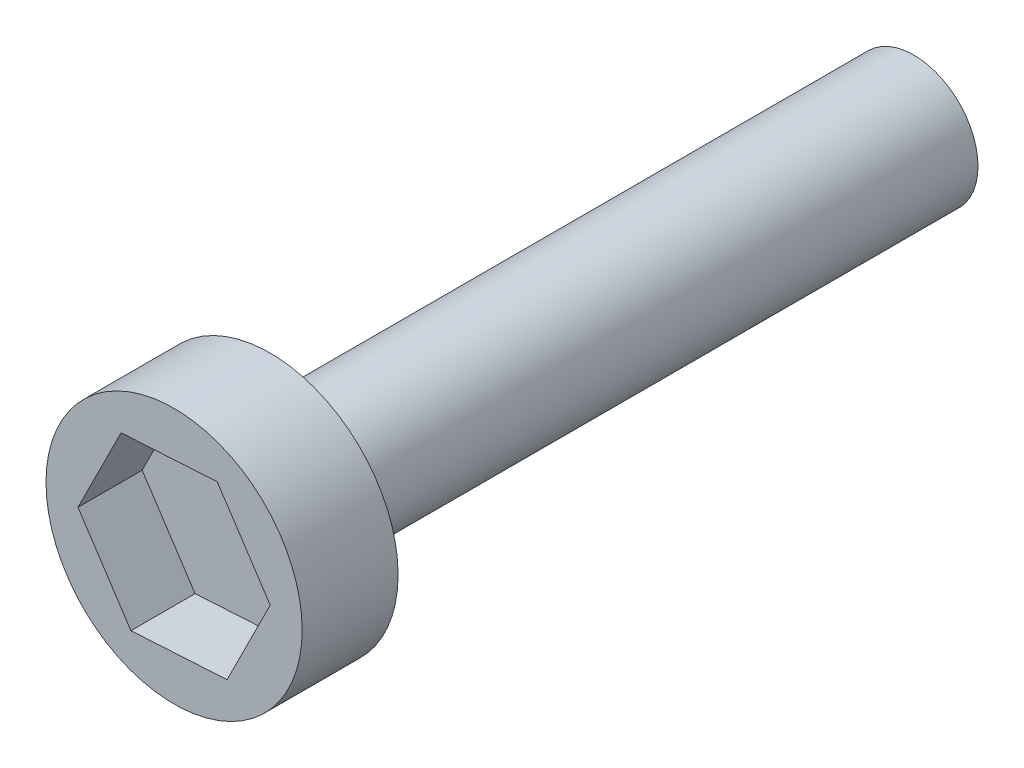
ISO-10303-21;
HEADER;
FILE_DESCRIPTION(('STEP AP214'),'2;1');
FILE_NAME('part.step','',(''),(''),'','','');
FILE_SCHEMA(('AUTOMOTIVE_DESIGN { 1 0 10303 214 1 1 1 1 }'));
ENDSEC;
DATA;
#1=APPLICATION_CONTEXT('core data for automotive mechanical design processes');
#2=APPLICATION_PROTOCOL_DEFINITION('international standard','automotive_design',2000,#1);
#3=PRODUCT_CONTEXT('',#1,'mechanical');
#4=PRODUCT('Part','Part','',(#3));
#5=PRODUCT_RELATED_PRODUCT_CATEGORY('part','',(#4));
#6=PRODUCT_DEFINITION_FORMATION('','',#4);
#7=PRODUCT_DEFINITION_CONTEXT('part definition',#1,'design');
#8=PRODUCT_DEFINITION('design','',#6,#7);
#9=PRODUCT_DEFINITION_SHAPE('','',#8);
#10=(LENGTH_UNIT() NAMED_UNIT(*) SI_UNIT(.MILLI.,.METRE.));
#11=(NAMED_UNIT(*) PLANE_ANGLE_UNIT() SI_UNIT($,.RADIAN.));
#12=(NAMED_UNIT(*) SI_UNIT($,.STERADIAN.) SOLID_ANGLE_UNIT());
#13=UNCERTAINTY_MEASURE_WITH_UNIT(LENGTH_MEASURE(1.E-05),#10,'distance_accuracy_value','');
#14=(GEOMETRIC_REPRESENTATION_CONTEXT(3) GLOBAL_UNCERTAINTY_ASSIGNED_CONTEXT((#13)) GLOBAL_UNIT_ASSIGNED_CONTEXT((#10,
#11,#12)) REPRESENTATION_CONTEXT('',''));
#15=CARTESIAN_POINT('',(0.,0.,0.));
#16=DIRECTION('',(0.,0.,1.));
#17=DIRECTION('',(1.,0.,0.));
#18=AXIS2_PLACEMENT_3D('',#15,#16,#17);
#19=CARTESIAN_POINT('',(0.,25.3396595086279,127.36474041182));
#20=DIRECTION('',(0.,0.,-1.));
#21=DIRECTION('',(-1.,0.,0.));
#22=AXIS2_PLACEMENT_3D('',#19,#20,#21);
#23=PLANE('',#22);
#24=CARTESIAN_POINT('',(0.,0.,127.36474041182));
#25=DIRECTION('',(0.,0.,-1.));
#26=DIRECTION('',(-1.,0.,0.));
#27=AXIS2_PLACEMENT_3D('',#24,#25,#26);
#28=CIRCLE('',#27,25.3396595086279);
#29=CARTESIAN_POINT('',(-25.3396595086279,0.,127.36474041182));
#30=VERTEX_POINT('',#29);
#31=EDGE_CURVE('E47',#30,#30,#28,.T.);
#32=ORIENTED_EDGE('',*,*,#31,.T.);
#33=EDGE_LOOP('',(#32));
#34=FACE_BOUND('',#33,.T.);
#35=ADVANCED_FACE('F40',(#34),#23,.T.);
#36=CARTESIAN_POINT('',(0.,0.,146.346083345567));
#37=DIRECTION('',(0.,0.,1.));
#38=DIRECTION('',(1.,0.,0.));
#39=AXIS2_PLACEMENT_3D('',#36,#37,#38);
#40=PLANE('',#39);
#41=DIRECTION('',(-0.550075734631953,0.835114774249095,0.));
#42=VECTOR('',#41,1.);
#43=CARTESIAN_POINT('',(19.0170144847812,1.12056239702373,146.346083345567));
#44=LINE('',#43,#42);
#45=CARTESIAN_POINT('',(19.0170144847812,1.12056239702373,146.346083345567));
#46=VERTEX_POINT('',#45);
#47=CARTESIAN_POINT('',(8.53807174004245,17.029498846469,146.346083345567));
#48=VERTEX_POINT('',#47);
#49=EDGE_CURVE('E54',#46,#48,#44,.T.);
#50=ORIENTED_EDGE('',*,*,#49,.F.);
#51=DIRECTION('',(0.448192742259446,0.893936947321207,0.));
#52=VECTOR('',#51,1.);
#53=CARTESIAN_POINT('',(10.4789427447387,-15.9089364494453,146.346083345567));
#54=LINE('',#53,#52);
#55=CARTESIAN_POINT('',(10.4789427447387,-15.9089364494453,146.346083345567));
#56=VERTEX_POINT('',#55);
#57=EDGE_CURVE('E137',#56,#46,#54,.T.);
#58=ORIENTED_EDGE('',*,*,#57,.F.);
#59=DIRECTION('',(0.9982684768914,0.0588221730721117,0.));
#60=VECTOR('',#59,1.);
#61=CARTESIAN_POINT('',(-8.53807174004244,-17.029498846469,146.346083345567));
#62=LINE('',#61,#60);
#63=CARTESIAN_POINT('',(-8.53807174004244,-17.029498846469,146.346083345567));
#64=VERTEX_POINT('',#63);
#65=EDGE_CURVE('E135',#64,#56,#62,.T.);
#66=ORIENTED_EDGE('',*,*,#65,.F.);
#67=DIRECTION('',(0.550075734631953,-0.835114774249095,0.));
#68=VECTOR('',#67,1.);
#69=CARTESIAN_POINT('',(-19.0170144847812,-1.12056239702374,146.346083345567));
#70=LINE('',#69,#68);
#71=CARTESIAN_POINT('',(-19.0170144847812,-1.12056239702374,146.346083345567));
#72=VERTEX_POINT('',#71);
#73=EDGE_CURVE('E102',#72,#64,#70,.T.);
#74=ORIENTED_EDGE('',*,*,#73,.F.);
#75=DIRECTION('',(-0.448192742259446,-0.893936947321207,0.));
#76=VECTOR('',#75,1.);
#77=CARTESIAN_POINT('',(-10.4789427447387,15.9089364494453,146.346083345567));
#78=LINE('',#77,#76);
#79=CARTESIAN_POINT('',(-10.4789427447387,15.9089364494453,146.346083345567));
#80=VERTEX_POINT('',#79);
#81=EDGE_CURVE('E131',#80,#72,#78,.T.);
#82=ORIENTED_EDGE('',*,*,#81,.F.);
#83=DIRECTION('',(-0.9982684768914,-0.0588221730721119,0.));
#84=VECTOR('',#83,1.);
#85=CARTESIAN_POINT('',(8.53807174004245,17.029498846469,146.346083345567));
#86=LINE('',#85,#84);
#87=EDGE_CURVE('E128',#48,#80,#86,.T.);
#88=ORIENTED_EDGE('',*,*,#87,.F.);
#89=EDGE_LOOP('',(#50,#58,#66,#74,#82,#88));
#90=FACE_BOUND('',#89,.T.);
#91=CARTESIAN_POINT('',(0.,0.,146.346083345567));
#92=DIRECTION('',(0.,0.,-1.));
#93=DIRECTION('',(-1.,0.,0.));
#94=AXIS2_PLACEMENT_3D('',#91,#92,#93);
#95=CIRCLE('',#94,25.3396595086279);
#96=CARTESIAN_POINT('',(-25.3396595086279,0.,146.346083345567));
#97=VERTEX_POINT('',#96);
#98=EDGE_CURVE('E12',#97,#97,#95,.T.);
#99=ORIENTED_EDGE('',*,*,#98,.F.);
#100=EDGE_LOOP('',(#99));
#101=FACE_BOUND('',#100,.T.);
#102=ADVANCED_FACE('F152',(#90,#101),#40,.T.);
#103=CARTESIAN_POINT('',(0.,0.,127.36474041182));
#104=DIRECTION('',(0.,0.,-1.));
#105=DIRECTION('',(-1.,0.,0.));
#106=AXIS2_PLACEMENT_3D('',#103,#104,#105);
#107=CYLINDRICAL_SURFACE('',#106,25.3396595086279);
#108=ORIENTED_EDGE('',*,*,#98,.T.);
#109=EDGE_LOOP('',(#108));
#110=FACE_BOUND('',#109,.T.);
#111=ORIENTED_EDGE('',*,*,#31,.F.);
#112=EDGE_LOOP('',(#111));
#113=FACE_BOUND('',#112,.T.);
#114=ADVANCED_FACE('F149',(#110,#113),#107,.T.);
#115=CARTESIAN_POINT('',(19.0170144847812,1.12056239702373,133.646083345567));
#116=DIRECTION('',(0.835114774249095,0.550075734631953,0.));
#117=DIRECTION('',(-0.550075734631953,0.835114774249095,0.));
#118=AXIS2_PLACEMENT_3D('',#115,#116,#117);
#119=PLANE('',#118);
#120=ORIENTED_EDGE('',*,*,#49,.T.);
#121=DIRECTION('',(0.,0.,1.));
#122=VECTOR('',#121,1.);
#123=CARTESIAN_POINT('',(8.53807174004245,17.029498846469,133.646083345567));
#124=LINE('',#123,#122);
#125=CARTESIAN_POINT('',(8.53807174004245,17.029498846469,133.646083345567));
#126=VERTEX_POINT('',#125);
#127=EDGE_CURVE('E84',#126,#48,#124,.T.);
#128=ORIENTED_EDGE('',*,*,#127,.F.);
#129=DIRECTION('',(-0.550075734631953,0.835114774249095,0.));
#130=VECTOR('',#129,1.);
#131=CARTESIAN_POINT('',(19.0170144847812,1.12056239702373,133.646083345567));
#132=LINE('',#131,#130);
#133=CARTESIAN_POINT('',(19.0170144847812,1.12056239702373,133.646083345567));
#134=VERTEX_POINT('',#133);
#135=EDGE_CURVE('E139',#134,#126,#132,.T.);
#136=ORIENTED_EDGE('',*,*,#135,.F.);
#137=DIRECTION('',(0.,0.,1.));
#138=VECTOR('',#137,1.);
#139=CARTESIAN_POINT('',(19.0170144847812,1.12056239702373,133.646083345567));
#140=LINE('',#139,#138);
#141=EDGE_CURVE('E62',#134,#46,#140,.T.);
#142=ORIENTED_EDGE('',*,*,#141,.T.);
#143=EDGE_LOOP('',(#120,#128,#136,#142));
#144=FACE_BOUND('',#143,.T.);
#145=ADVANCED_FACE('F151',(#144),#119,.F.);
#146=CARTESIAN_POINT('',(10.4789427447387,-15.9089364494453,133.646083345567));
#147=DIRECTION('',(0.893936947321207,-0.448192742259446,0.));
#148=DIRECTION('',(0.448192742259446,0.893936947321207,0.));
#149=AXIS2_PLACEMENT_3D('',#146,#147,#148);
#150=PLANE('',#149);
#151=ORIENTED_EDGE('',*,*,#57,.T.);
#152=ORIENTED_EDGE('',*,*,#141,.F.);
#153=DIRECTION('',(0.448192742259446,0.893936947321207,0.));
#154=VECTOR('',#153,1.);
#155=CARTESIAN_POINT('',(10.4789427447387,-15.9089364494453,133.646083345567));
#156=LINE('',#155,#154);
#157=CARTESIAN_POINT('',(10.4789427447387,-15.9089364494453,133.646083345567));
#158=VERTEX_POINT('',#157);
#159=EDGE_CURVE('E114',#158,#134,#156,.T.);
#160=ORIENTED_EDGE('',*,*,#159,.F.);
#161=DIRECTION('',(0.,0.,1.));
#162=VECTOR('',#161,1.);
#163=CARTESIAN_POINT('',(10.4789427447387,-15.9089364494453,133.646083345567));
#164=LINE('',#163,#162);
#165=EDGE_CURVE('E106',#158,#56,#164,.T.);
#166=ORIENTED_EDGE('',*,*,#165,.T.);
#167=EDGE_LOOP('',(#151,#152,#160,#166));
#168=FACE_BOUND('',#167,.T.);
#169=ADVANCED_FACE('F159',(#168),#150,.F.);
#170=CARTESIAN_POINT('',(-8.53807174004244,-17.029498846469,133.646083345567));
#171=DIRECTION('',(0.0588221730721117,-0.998268476891399,0.));
#172=DIRECTION('',(0.998268476891399,0.0588221730721117,0.));
#173=AXIS2_PLACEMENT_3D('',#170,#171,#172);
#174=PLANE('',#173);
#175=ORIENTED_EDGE('',*,*,#65,.T.);
#176=ORIENTED_EDGE('',*,*,#165,.F.);
#177=DIRECTION('',(0.9982684768914,0.0588221730721117,0.));
#178=VECTOR('',#177,1.);
#179=CARTESIAN_POINT('',(-8.53807174004244,-17.029498846469,133.646083345567));
#180=LINE('',#179,#178);
#181=CARTESIAN_POINT('',(-8.53807174004244,-17.029498846469,133.646083345567));
#182=VERTEX_POINT('',#181);
#183=EDGE_CURVE('E110',#182,#158,#180,.T.);
#184=ORIENTED_EDGE('',*,*,#183,.F.);
#185=DIRECTION('',(0.,0.,1.));
#186=VECTOR('',#185,1.);
#187=CARTESIAN_POINT('',(-8.53807174004244,-17.029498846469,133.646083345567));
#188=LINE('',#187,#186);
#189=EDGE_CURVE('E95',#182,#64,#188,.T.);
#190=ORIENTED_EDGE('',*,*,#189,.T.);
#191=EDGE_LOOP('',(#175,#176,#184,#190));
#192=FACE_BOUND('',#191,.T.);
#193=ADVANCED_FACE('F111',(#192),#174,.F.);
#194=CARTESIAN_POINT('',(-19.0170144847812,-1.12056239702374,133.646083345567));
#195=DIRECTION('',(-0.835114774249095,-0.550075734631953,0.));
#196=DIRECTION('',(0.550075734631953,-0.835114774249095,0.));
#197=AXIS2_PLACEMENT_3D('',#194,#195,#196);
#198=PLANE('',#197);
#199=ORIENTED_EDGE('',*,*,#73,.T.);
#200=ORIENTED_EDGE('',*,*,#189,.F.);
#201=DIRECTION('',(0.550075734631953,-0.835114774249095,0.));
#202=VECTOR('',#201,1.);
#203=CARTESIAN_POINT('',(-19.0170144847812,-1.12056239702374,133.646083345567));
#204=LINE('',#203,#202);
#205=CARTESIAN_POINT('',(-19.0170144847812,-1.12056239702374,133.646083345567));
#206=VERTEX_POINT('',#205);
#207=EDGE_CURVE('E99',#206,#182,#204,.T.);
#208=ORIENTED_EDGE('',*,*,#207,.F.);
#209=DIRECTION('',(0.,0.,1.));
#210=VECTOR('',#209,1.);
#211=CARTESIAN_POINT('',(-19.0170144847812,-1.12056239702374,133.646083345567));
#212=LINE('',#211,#210);
#213=EDGE_CURVE('E107',#206,#72,#212,.T.);
#214=ORIENTED_EDGE('',*,*,#213,.T.);
#215=EDGE_LOOP('',(#199,#200,#208,#214));
#216=FACE_BOUND('',#215,.T.);
#217=ADVANCED_FACE('F97',(#216),#198,.F.);
#218=CARTESIAN_POINT('',(-10.4789427447387,15.9089364494453,133.646083345567));
#219=DIRECTION('',(-0.893936947321207,0.448192742259446,0.));
#220=DIRECTION('',(-0.448192742259446,-0.893936947321207,0.));
#221=AXIS2_PLACEMENT_3D('',#218,#219,#220);
#222=PLANE('',#221);
#223=ORIENTED_EDGE('',*,*,#81,.T.);
#224=ORIENTED_EDGE('',*,*,#213,.F.);
#225=DIRECTION('',(-0.448192742259446,-0.893936947321207,0.));
#226=VECTOR('',#225,1.);
#227=CARTESIAN_POINT('',(-10.4789427447387,15.9089364494453,133.646083345567));
#228=LINE('',#227,#226);
#229=CARTESIAN_POINT('',(-10.4789427447387,15.9089364494453,133.646083345567));
#230=VERTEX_POINT('',#229);
#231=EDGE_CURVE('E120',#230,#206,#228,.T.);
#232=ORIENTED_EDGE('',*,*,#231,.F.);
#233=DIRECTION('',(0.,0.,1.));
#234=VECTOR('',#233,1.);
#235=CARTESIAN_POINT('',(-10.4789427447387,15.9089364494453,133.646083345567));
#236=LINE('',#235,#234);
#237=EDGE_CURVE('E143',#230,#80,#236,.T.);
#238=ORIENTED_EDGE('',*,*,#237,.T.);
#239=EDGE_LOOP('',(#223,#224,#232,#238));
#240=FACE_BOUND('',#239,.T.);
#241=ADVANCED_FACE('F202',(#240),#222,.F.);
#242=CARTESIAN_POINT('',(8.53807174004245,17.029498846469,133.646083345567));
#243=DIRECTION('',(-0.0588221730721119,0.998268476891399,0.));
#244=DIRECTION('',(-0.998268476891399,-0.0588221730721119,0.));
#245=AXIS2_PLACEMENT_3D('',#242,#243,#244);
#246=PLANE('',#245);
#247=ORIENTED_EDGE('',*,*,#87,.T.);
#248=ORIENTED_EDGE('',*,*,#237,.F.);
#249=DIRECTION('',(-0.9982684768914,-0.0588221730721119,0.));
#250=VECTOR('',#249,1.);
#251=CARTESIAN_POINT('',(8.53807174004245,17.029498846469,133.646083345567));
#252=LINE('',#251,#250);
#253=EDGE_CURVE('E122',#126,#230,#252,.T.);
#254=ORIENTED_EDGE('',*,*,#253,.F.);
#255=ORIENTED_EDGE('',*,*,#127,.T.);
#256=EDGE_LOOP('',(#247,#248,#254,#255));
#257=FACE_BOUND('',#256,.T.);
#258=ADVANCED_FACE('F211',(#257),#246,.F.);
#259=CARTESIAN_POINT('',(0.,0.,133.646083345567));
#260=DIRECTION('',(0.,0.,1.));
#261=DIRECTION('',(1.,0.,0.));
#262=AXIS2_PLACEMENT_3D('',#259,#260,#261);
#263=PLANE('',#262);
#264=ORIENTED_EDGE('',*,*,#135,.T.);
#265=ORIENTED_EDGE('',*,*,#253,.T.);
#266=ORIENTED_EDGE('',*,*,#231,.T.);
#267=ORIENTED_EDGE('',*,*,#207,.T.);
#268=ORIENTED_EDGE('',*,*,#183,.T.);
#269=ORIENTED_EDGE('',*,*,#159,.T.);
#270=EDGE_LOOP('',(#264,#265,#266,#267,#268,#269));
#271=FACE_BOUND('',#270,.T.);
#272=ADVANCED_FACE('F117',(#271),#263,.T.);
#273=CLOSED_SHELL('',(#35,#102,#114,#145,#169,#193,#217,#241,#258,#272));
#274=MANIFOLD_SOLID_BREP('B2',#273);
#275=CARTESIAN_POINT('',(0.,0.,127.));
#276=DIRECTION('',(0.,0.,-1.));
#277=DIRECTION('',(-1.,0.,0.));
#278=AXIS2_PLACEMENT_3D('',#275,#276,#277);
#279=CYLINDRICAL_SURFACE('',#278,12.6998093163396);
#280=CARTESIAN_POINT('',(0.,0.,127.));
#281=DIRECTION('',(0.,0.,1.));
#282=DIRECTION('',(1.,0.,0.));
#283=AXIS2_PLACEMENT_3D('',#280,#281,#282);
#284=CIRCLE('',#283,12.6998093163396);
#285=CARTESIAN_POINT('',(12.6998093163396,0.,127.));
#286=VERTEX_POINT('',#285);
#287=EDGE_CURVE('E39',#286,#286,#284,.T.);
#288=ORIENTED_EDGE('',*,*,#287,.F.);
#289=EDGE_LOOP('',(#288));
#290=FACE_BOUND('',#289,.T.);
#291=CARTESIAN_POINT('',(0.,0.,0.));
#292=DIRECTION('',(0.,0.,1.));
#293=DIRECTION('',(1.,0.,0.));
#294=AXIS2_PLACEMENT_3D('',#291,#292,#293);
#295=CIRCLE('',#294,12.6998093163396);
#296=CARTESIAN_POINT('',(12.6998093163396,0.,0.));
#297=VERTEX_POINT('',#296);
#298=EDGE_CURVE('E248',#297,#297,#295,.T.);
#299=ORIENTED_EDGE('',*,*,#298,.T.);
#300=EDGE_LOOP('',(#299));
#301=FACE_BOUND('',#300,.T.);
#302=ADVANCED_FACE('F245',(#290,#301),#279,.T.);
#303=CARTESIAN_POINT('',(0.,0.,127.));
#304=DIRECTION('',(0.,0.,1.));
#305=DIRECTION('',(1.,0.,0.));
#306=AXIS2_PLACEMENT_3D('',#303,#304,#305);
#307=PLANE('',#306);
#308=ORIENTED_EDGE('',*,*,#287,.T.);
#309=EDGE_LOOP('',(#308));
#310=FACE_BOUND('',#309,.T.);
#311=ADVANCED_FACE('F260',(#310),#307,.T.);
#312=CARTESIAN_POINT('',(0.,0.,0.));
#313=DIRECTION('',(0.,0.,1.));
#314=DIRECTION('',(1.,0.,0.));
#315=AXIS2_PLACEMENT_3D('',#312,#313,#314);
#316=PLANE('',#315);
#317=ORIENTED_EDGE('',*,*,#298,.F.);
#318=EDGE_LOOP('',(#317));
#319=FACE_BOUND('',#318,.T.);
#320=ADVANCED_FACE('F258',(#319),#316,.F.);
#321=CLOSED_SHELL('',(#302,#311,#320));
#322=MANIFOLD_SOLID_BREP('B6',#321);
#323=ADVANCED_BREP_SHAPE_REPRESENTATION('',(#18,#274,#322),#14);
#324=SHAPE_DEFINITION_REPRESENTATION(#9,#323);
ENDSEC;
END-ISO-10303-21;
